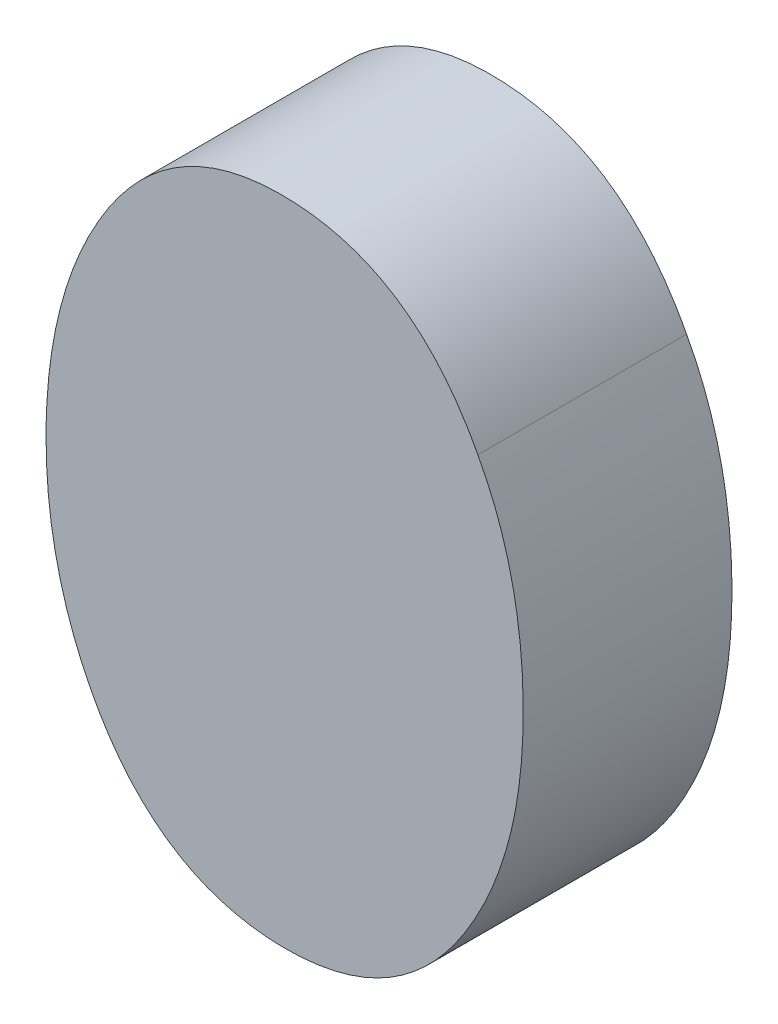
ISO-10303-21;
HEADER;
FILE_DESCRIPTION(('STEP AP214'),'2;1');
FILE_NAME('part.step','',(''),(''),'','','');
FILE_SCHEMA(('AUTOMOTIVE_DESIGN { 1 0 10303 214 1 1 1 1 }'));
ENDSEC;
DATA;
#1=APPLICATION_CONTEXT('core data for automotive mechanical design processes');
#2=APPLICATION_PROTOCOL_DEFINITION('international standard','automotive_design',2000,#1);
#3=PRODUCT_CONTEXT('',#1,'mechanical');
#4=PRODUCT('Part','Part','',(#3));
#5=PRODUCT_RELATED_PRODUCT_CATEGORY('part','',(#4));
#6=PRODUCT_DEFINITION_FORMATION('','',#4);
#7=PRODUCT_DEFINITION_CONTEXT('part definition',#1,'design');
#8=PRODUCT_DEFINITION('design','',#6,#7);
#9=PRODUCT_DEFINITION_SHAPE('','',#8);
#10=(LENGTH_UNIT() NAMED_UNIT(*) SI_UNIT(.MILLI.,.METRE.));
#11=(NAMED_UNIT(*) PLANE_ANGLE_UNIT() SI_UNIT($,.RADIAN.));
#12=(NAMED_UNIT(*) SI_UNIT($,.STERADIAN.) SOLID_ANGLE_UNIT());
#13=UNCERTAINTY_MEASURE_WITH_UNIT(LENGTH_MEASURE(1.E-05),#10,'distance_accuracy_value','');
#14=(GEOMETRIC_REPRESENTATION_CONTEXT(3) GLOBAL_UNCERTAINTY_ASSIGNED_CONTEXT((#13)) GLOBAL_UNIT_ASSIGNED_CONTEXT((#10,
#11,#12)) REPRESENTATION_CONTEXT('',''));
#15=CARTESIAN_POINT('',(0.,0.,0.));
#16=DIRECTION('',(0.,0.,1.));
#17=DIRECTION('',(1.,0.,0.));
#18=AXIS2_PLACEMENT_3D('',#15,#16,#17);
#19=CARTESIAN_POINT('',(173.744858544008,131.368774372739,-38.9997200126349));
#20=DIRECTION('',(0.,0.,-1.));
#21=DIRECTION('',(-1.,0.,0.));
#22=AXIS2_PLACEMENT_3D('',#19,#20,#21);
#23=PLANE('',#22);
#24=CARTESIAN_POINT('',(173.9034454652,131.332766214631,-38.9997200126349));
#25=CARTESIAN_POINT('',(173.908014798087,131.324429820084,-38.9997200126349));
#26=CARTESIAN_POINT('',(173.911753346443,131.315698091519,-38.9997200126349));
#27=CARTESIAN_POINT('',(173.917767937484,131.297737241665,-38.9997200126349));
#28=CARTESIAN_POINT('',(173.920044049126,131.28850814385,-38.9997200126349));
#29=CARTESIAN_POINT('',(173.92410120989,131.265487346003,-38.9997200126349));
#30=CARTESIAN_POINT('',(173.925154726982,131.25157758709,-38.9997200126349));
#31=CARTESIAN_POINT('',(173.925199285493,131.223729594472,-38.9997200126349));
#32=CARTESIAN_POINT('',(173.924187736672,131.209791346939,-38.9997200126349));
#33=CARTESIAN_POINT('',(173.920077770833,131.186582989459,-38.9997200126349));
#34=CARTESIAN_POINT('',(173.917713135645,131.1771902406,-38.9997200126349));
#35=CARTESIAN_POINT('',(173.911499948026,131.158922910163,-38.9997200126349));
#36=CARTESIAN_POINT('',(173.907654373367,131.150047329667,-38.9997200126349));
#37=CARTESIAN_POINT('',(173.899910426115,131.13558420799,-38.9997200126349));
#38=CARTESIAN_POINT('',(173.896368486896,131.129804333401,-38.9997200126349));
#39=CARTESIAN_POINT('',(173.888453564095,131.118835316594,-38.9997200126349));
#40=CARTESIAN_POINT('',(173.884081980822,131.113645202219,-38.9997200126349));
#41=CARTESIAN_POINT('',(173.87550212016,131.105236029308,-38.9997200126349));
#42=CARTESIAN_POINT('',(173.87147353095,131.101835278752,-38.9997200126349));
#43=CARTESIAN_POINT('',(173.862902183948,131.095763099117,-38.9997200126349));
#44=CARTESIAN_POINT('',(173.858360176809,131.09309062427,-38.9997200126349));
#45=CARTESIAN_POINT('',(173.848867032974,131.088589966005,-38.9997200126349));
#46=CARTESIAN_POINT('',(173.84391529639,131.086763047304,-38.9997200126349));
#47=CARTESIAN_POINT('',(173.833764810372,131.083977413198,-38.9997200126349));
#48=CARTESIAN_POINT('',(173.828565487571,131.08302082762,-38.9997200126349));
#49=CARTESIAN_POINT('',(173.818110620974,131.081898738138,-38.9997200126349));
#50=CARTESIAN_POINT('',(173.812855382256,131.08173010925,-38.9997200126349));
#51=CARTESIAN_POINT('',(173.802367109949,131.082070720413,-38.9997200126349));
#52=CARTESIAN_POINT('',(173.797134071073,131.082579788744,-38.9997200126349));
#53=CARTESIAN_POINT('',(173.786792342219,131.084404536079,-38.9997200126349));
#54=CARTESIAN_POINT('',(173.781683915822,131.085721792712,-38.9997200126349));
#55=CARTESIAN_POINT('',(173.77177673162,131.089204765122,-38.9997200126349));
#56=CARTESIAN_POINT('',(173.766977217797,131.091368310024,-38.9997200126349));
#57=CARTESIAN_POINT('',(173.757825187715,131.096496083361,-38.9997200126349));
#58=CARTESIAN_POINT('',(173.753472902209,131.099460722295,-38.9997200126349));
#59=CARTESIAN_POINT('',(173.745304502827,131.106057418902,-38.9997200126349));
#60=CARTESIAN_POINT('',(173.741489106349,131.109690354894,-38.9997200126349));
#61=CARTESIAN_POINT('',(173.734025772993,131.117879715374,-38.9997200126349));
#62=CARTESIAN_POINT('',(173.730442302138,131.122493750101,-38.9997200126349));
#63=CARTESIAN_POINT('',(173.723929472304,131.13209855056,-38.9997200126349));
#64=CARTESIAN_POINT('',(173.72099391046,131.13708507139,-38.9997200126349));
#65=CARTESIAN_POINT('',(173.718331830667,131.14218918975,-38.9997200126349));
#66=B_SPLINE_CURVE_WITH_KNOTS('',3,(#24,#25,#26,#27,#28,#29,#30,#31,#32,#33,#34,#35,#36,#37,#38,
#39,#40,#41,#42,#43,#44,#45,#46,#47,#48,#49,#50,#51,#52,#53,#54,#55,#56,#57,#58,#59,#60,#61,#62,
#63,#64,#65),.UNSPECIFIED.,.F.,.F.,(4,2,2,2,2,2,2,2,2,2,2,2,2,2,2,2,2,2,2,2,4),(0.,
0.0284002238752622,0.0567991085106313,0.0984596537863421,0.140172486566024,0.169113750862,
0.197997123348401,0.218283145768268,0.238535228279963,0.254285736121527,0.270013506391512,
0.285764725627308,0.301554387415125,0.31728137497848,0.333004378282418,0.348758171865596,
0.364471816503089,0.380193528458672,0.39593605244051,0.41340836395186,0.430705349465679),.UNSPECIFIED.);
#67=CARTESIAN_POINT('',(173.9034454652,131.332766214631,-38.9997200126349));
#68=VERTEX_POINT('',#67);
#69=CARTESIAN_POINT('',(173.718331830667,131.14218918975,-38.9997200126349));
#70=VERTEX_POINT('',#69);
#71=EDGE_CURVE('E53',#68,#70,#66,.T.);
#72=ORIENTED_EDGE('',*,*,#71,.F.);
#73=CARTESIAN_POINT('',(173.718331830667,131.14218918975,-38.9997200126349));
#74=CARTESIAN_POINT('',(173.713465161089,131.151433702495,-38.9997200126349));
#75=CARTESIAN_POINT('',(173.709474514871,131.161097828992,-38.9997200126349));
#76=CARTESIAN_POINT('',(173.703136808004,131.180947955797,-38.9997200126349));
#77=CARTESIAN_POINT('',(173.700788446171,131.191133536073,-38.9997200126349));
#78=CARTESIAN_POINT('',(173.697157768974,131.2147249678,-38.9997200126349));
#79=CARTESIAN_POINT('',(173.696385495814,131.228204322194,-38.9997200126349));
#80=CARTESIAN_POINT('',(173.696898251483,131.25514183702,-38.9997200126349));
#81=CARTESIAN_POINT('',(173.698185533359,131.268599958098,-38.9997200126349));
#82=CARTESIAN_POINT('',(173.702617759272,131.291403239048,-38.9997200126349));
#83=CARTESIAN_POINT('',(173.705154996063,131.300862334052,-38.9997200126349));
#84=CARTESIAN_POINT('',(173.711704303877,131.319246215228,-38.9997200126349));
#85=CARTESIAN_POINT('',(173.715713511503,131.3281719999,-38.9997200126349));
#86=CARTESIAN_POINT('',(173.723622066103,131.342396171386,-38.9997200126349));
#87=CARTESIAN_POINT('',(173.727120366499,131.347918958266,-38.9997200126349));
#88=CARTESIAN_POINT('',(173.734898322058,131.358391228469,-38.9997200126349));
#89=CARTESIAN_POINT('',(173.739176581082,131.363341710758,-38.9997200126349));
#90=CARTESIAN_POINT('',(173.747598975663,131.371412417255,-38.9997200126349));
#91=CARTESIAN_POINT('',(173.751582475385,131.374698659819,-38.9997200126349));
#92=CARTESIAN_POINT('',(173.760045855468,131.380549741944,-38.9997200126349));
#93=CARTESIAN_POINT('',(173.764525020381,131.383115602855,-38.9997200126349));
#94=CARTESIAN_POINT('',(173.773873490376,131.387415225856,-38.9997200126349));
#95=CARTESIAN_POINT('',(173.778743301064,131.389147888593,-38.9997200126349));
#96=CARTESIAN_POINT('',(173.788714048544,131.391764140243,-38.9997200126349));
#97=CARTESIAN_POINT('',(173.793815520235,131.392645647328,-38.9997200126349));
#98=CARTESIAN_POINT('',(173.804086205437,131.393643217148,-38.9997200126349));
#99=CARTESIAN_POINT('',(173.809255432629,131.393759122841,-38.9997200126349));
#100=CARTESIAN_POINT('',(173.819567010062,131.393338376308,-38.9997200126349));
#101=CARTESIAN_POINT('',(173.824709365319,131.392801850576,-38.9997200126349));
#102=CARTESIAN_POINT('',(173.83497847603,131.390930283696,-38.9997200126349));
#103=CARTESIAN_POINT('',(173.840102071977,131.389576915391,-38.9997200126349));
#104=CARTESIAN_POINT('',(173.850032702033,131.386018842797,-38.9997200126349));
#105=CARTESIAN_POINT('',(173.854840500084,131.383816288762,-38.9997200126349));
#106=CARTESIAN_POINT('',(173.864001857796,131.378612056683,-38.9997200126349));
#107=CARTESIAN_POINT('',(173.868355310932,131.375610191818,-38.9997200126349));
#108=CARTESIAN_POINT('',(173.876524346886,131.368943840898,-38.9997200126349));
#109=CARTESIAN_POINT('',(173.880339190828,131.36527846004,-38.9997200126349));
#110=CARTESIAN_POINT('',(173.887782664856,131.357050813192,-38.9997200126349));
#111=CARTESIAN_POINT('',(173.891350849299,131.35243494103,-38.9997200126349));
#112=CARTESIAN_POINT('',(173.897845698185,131.342836944387,-38.9997200126349));
#113=CARTESIAN_POINT('',(173.900778528535,131.337859030766,-38.9997200126349));
#114=CARTESIAN_POINT('',(173.9034454652,131.332766214631,-38.9997200126349));
#115=B_SPLINE_CURVE_WITH_KNOTS('',3,(#73,#74,#75,#76,#77,#78,#79,#80,#81,#82,#83,#84,#85,#86,
#87,#88,#89,#90,#91,#92,#93,#94,#95,#96,#97,#98,#99,#100,#101,#102,#103,#104,#105,#106,#107,
#108,#109,#110,#111,#112,#113,#114),.UNSPECIFIED.,.F.,.F.,(4,2,2,2,2,2,2,2,2,2,2,2,2,2,2,2,2,2,
2,2,4),(0.,0.0312452956068513,0.0624658073786385,0.10278381674285,0.143145962125516,
0.172416392621823,0.201630183025114,0.221195387434573,0.24072590767078,0.256153485646803,
0.271559078795236,0.286984943253559,0.30244844271982,0.31791511399735,0.333378787057574,
0.349203024041566,0.364987452289943,0.380775573011406,0.396585146078523,0.414035976474014,
0.431309003593059),.UNSPECIFIED.);
#116=EDGE_CURVE('E24',#70,#68,#115,.T.);
#117=ORIENTED_EDGE('',*,*,#116,.F.);
#118=EDGE_LOOP('',(#72,#117));
#119=FACE_BOUND('',#118,.T.);
#120=ADVANCED_FACE('F17',(#119),#23,.F.);
#121=CARTESIAN_POINT('',(173.9034454652,131.332766214631,-39.0997200126349));
#122=CARTESIAN_POINT('',(173.9034454652,131.332766214631,-38.9997200126349));
#123=CARTESIAN_POINT('',(173.882101125788,131.373528522731,-39.0997200126349));
#124=CARTESIAN_POINT('',(173.882101125788,131.373528522731,-38.9997200126349));
#125=CARTESIAN_POINT('',(173.850666735019,131.393644986468,-39.0997200126349));
#126=CARTESIAN_POINT('',(173.850666735019,131.393644986468,-38.9997200126349));
#127=CARTESIAN_POINT('',(173.769946324153,131.393644986468,-39.0997200126349));
#128=CARTESIAN_POINT('',(173.769946324153,131.393644986468,-38.9997200126349));
#129=CARTESIAN_POINT('',(173.739676170078,131.373528522731,-39.0997200126349));
#130=CARTESIAN_POINT('',(173.739676170078,131.373528522731,-38.9997200126349));
#131=CARTESIAN_POINT('',(173.704146658488,131.305676111366,-39.0997200126349));
#132=CARTESIAN_POINT('',(173.704146658488,131.305676111366,-38.9997200126349));
#133=CARTESIAN_POINT('',(173.696599412357,131.273475584668,-39.0997200126349));
#134=CARTESIAN_POINT('',(173.696599412357,131.273475584668,-38.9997200126349));
#135=CARTESIAN_POINT('',(173.696599412357,131.200950439089,-39.0997200126349));
#136=CARTESIAN_POINT('',(173.696599412357,131.200950439089,-38.9997200126349));
#137=CARTESIAN_POINT('',(173.703972911426,131.169716982233,-39.0997200126349));
#138=CARTESIAN_POINT('',(173.703972911426,131.169716982233,-38.9997200126349));
#139=CARTESIAN_POINT('',(173.718331830667,131.14218918975,-39.0997200126349));
#140=CARTESIAN_POINT('',(173.718331830667,131.14218918975,-38.9997200126349));
#141=B_SPLINE_SURFACE_WITH_KNOTS('',3,1,((#121,#122),(#123,#124),(#125,#126),(#127,#128),(#129,
#130),(#131,#132),(#133,#134),(#135,#136),(#137,#138),(#139,#140)),.UNSPECIFIED.,.F.,.F.,.F.,(4,
2,2,2,4),(2,2),(0.,0.309404738529147,0.607133826547679,0.805000731425108,1.),(1.,
1.09999999999999),.UNSPECIFIED.);
#142=CARTESIAN_POINT('',(173.718331830667,131.14218918975,-39.0997200126349));
#143=CARTESIAN_POINT('',(173.713465161089,131.151433702495,-39.0997200126349));
#144=CARTESIAN_POINT('',(173.709474514871,131.161097828992,-39.0997200126349));
#145=CARTESIAN_POINT('',(173.703136808004,131.180947955797,-39.0997200126349));
#146=CARTESIAN_POINT('',(173.700788446171,131.191133536073,-39.0997200126349));
#147=CARTESIAN_POINT('',(173.697157768974,131.2147249678,-39.0997200126349));
#148=CARTESIAN_POINT('',(173.696385495814,131.228204322194,-39.0997200126349));
#149=CARTESIAN_POINT('',(173.696898251483,131.25514183702,-39.0997200126349));
#150=CARTESIAN_POINT('',(173.698185533359,131.268599958098,-39.0997200126349));
#151=CARTESIAN_POINT('',(173.702617759272,131.291403239048,-39.0997200126349));
#152=CARTESIAN_POINT('',(173.705154996063,131.300862334052,-39.0997200126349));
#153=CARTESIAN_POINT('',(173.711704303877,131.319246215228,-39.0997200126349));
#154=CARTESIAN_POINT('',(173.715713511503,131.3281719999,-39.0997200126349));
#155=CARTESIAN_POINT('',(173.723622066103,131.342396171386,-39.0997200126349));
#156=CARTESIAN_POINT('',(173.727120366499,131.347918958266,-39.0997200126349));
#157=CARTESIAN_POINT('',(173.734898322058,131.358391228469,-39.0997200126349));
#158=CARTESIAN_POINT('',(173.739176581082,131.363341710758,-39.0997200126349));
#159=CARTESIAN_POINT('',(173.747598975663,131.371412417255,-39.0997200126349));
#160=CARTESIAN_POINT('',(173.751582475385,131.374698659819,-39.0997200126349));
#161=CARTESIAN_POINT('',(173.760045855468,131.380549741944,-39.0997200126349));
#162=CARTESIAN_POINT('',(173.764525020381,131.383115602855,-39.0997200126349));
#163=CARTESIAN_POINT('',(173.773873490376,131.387415225856,-39.0997200126349));
#164=CARTESIAN_POINT('',(173.778743301064,131.389147888593,-39.0997200126349));
#165=CARTESIAN_POINT('',(173.788714048544,131.391764140243,-39.0997200126349));
#166=CARTESIAN_POINT('',(173.793815520235,131.392645647328,-39.0997200126349));
#167=CARTESIAN_POINT('',(173.804086205437,131.393643217148,-39.0997200126349));
#168=CARTESIAN_POINT('',(173.80925543263,131.393759122841,-39.0997200126349));
#169=CARTESIAN_POINT('',(173.819567010062,131.393338376308,-39.0997200126349));
#170=CARTESIAN_POINT('',(173.824709365319,131.392801850576,-39.0997200126349));
#171=CARTESIAN_POINT('',(173.83497847603,131.390930283696,-39.0997200126349));
#172=CARTESIAN_POINT('',(173.840102071977,131.389576915391,-39.0997200126349));
#173=CARTESIAN_POINT('',(173.850032702033,131.386018842797,-39.0997200126349));
#174=CARTESIAN_POINT('',(173.854840500084,131.383816288762,-39.0997200126349));
#175=CARTESIAN_POINT('',(173.864001857796,131.378612056682,-39.0997200126349));
#176=CARTESIAN_POINT('',(173.868355310932,131.375610191818,-39.0997200126349));
#177=CARTESIAN_POINT('',(173.876524346886,131.368943840898,-39.0997200126349));
#178=CARTESIAN_POINT('',(173.880339190828,131.36527846004,-39.0997200126349));
#179=CARTESIAN_POINT('',(173.887782664856,131.357050813192,-39.0997200126349));
#180=CARTESIAN_POINT('',(173.891350849299,131.35243494103,-39.0997200126349));
#181=CARTESIAN_POINT('',(173.897845698185,131.342836944387,-39.0997200126349));
#182=CARTESIAN_POINT('',(173.900778528535,131.337859030766,-39.0997200126349));
#183=CARTESIAN_POINT('',(173.9034454652,131.332766214631,-39.0997200126349));
#184=B_SPLINE_CURVE_WITH_KNOTS('',3,(#142,#143,#144,#145,#146,#147,#148,#149,#150,#151,#152,
#153,#154,#155,#156,#157,#158,#159,#160,#161,#162,#163,#164,#165,#166,#167,#168,#169,#170,#171,
#172,#173,#174,#175,#176,#177,#178,#179,#180,#181,#182,#183),.UNSPECIFIED.,.F.,.F.,(4,2,2,2,2,2,
2,2,2,2,2,2,2,2,2,2,2,2,2,2,4),(0.,0.0312452956068513,0.0624658073786385,0.102783816742852,
0.143145962125521,0.172416392621827,0.201630183025118,0.221195387434586,0.24072590767079,
0.256153485646856,0.271559078795317,0.286984943253682,0.302448442720026,0.317915113997582,
0.333378787057816,0.349203024041754,0.364987452290055,0.38077557301148,0.39658514607848,
0.414035976474005,0.43130900359307),.UNSPECIFIED.);
#185=CARTESIAN_POINT('',(173.718331830667,131.14218918975,-39.0997200126349));
#186=VERTEX_POINT('',#185);
#187=CARTESIAN_POINT('',(173.9034454652,131.332766214631,-39.0997200126349));
#188=VERTEX_POINT('',#187);
#189=EDGE_CURVE('E35',#186,#188,#184,.T.);
#190=DIRECTION('',(0.,0.,-1.));
#191=VECTOR('',#190,1.);
#192=CARTESIAN_POINT('',(173.718331830667,131.14218918975,-39.0497200126349));
#193=LINE('',#192,#191);
#194=EDGE_CURVE('E56',#70,#186,#193,.T.);
#195=DIRECTION('',(0.,0.,1.));
#196=VECTOR('',#195,1.);
#197=CARTESIAN_POINT('',(173.9034454652,131.332766214631,-39.0497200126349));
#198=LINE('',#197,#196);
#199=EDGE_CURVE('E44',#188,#68,#198,.T.);
#200=ORIENTED_EDGE('',*,*,#189,.F.);
#201=ORIENTED_EDGE('',*,*,#194,.F.);
#202=ORIENTED_EDGE('',*,*,#116,.T.);
#203=ORIENTED_EDGE('',*,*,#199,.F.);
#204=EDGE_LOOP('',(#200,#201,#202,#203));
#205=FACE_BOUND('',#204,.T.);
#206=ADVANCED_FACE('F57',(#205),#141,.T.);
#207=CARTESIAN_POINT('',(173.718331830667,131.14218918975,-39.0997200126349));
#208=CARTESIAN_POINT('',(173.718331830667,131.14218918975,-38.9997200126349));
#209=CARTESIAN_POINT('',(173.739395075811,131.101808390079,-39.0997200126349));
#210=CARTESIAN_POINT('',(173.739395075811,131.101808390079,-38.9997200126349));
#211=CARTESIAN_POINT('',(173.77072248195,131.081839798538,-39.0997200126349));
#212=CARTESIAN_POINT('',(173.77072248195,131.081839798538,-38.9997200126349));
#213=CARTESIAN_POINT('',(173.851442892815,131.081839798538,-39.0997200126349));
#214=CARTESIAN_POINT('',(173.851442892815,131.081839798538,-38.9997200126349));
#215=CARTESIAN_POINT('',(173.882101125788,131.101956262275,-39.0997200126349));
#216=CARTESIAN_POINT('',(173.882101125788,131.101956262275,-38.9997200126349));
#217=CARTESIAN_POINT('',(173.918081009141,131.169776399951,-39.0997200126349));
#218=CARTESIAN_POINT('',(173.918081009141,131.169776399951,-38.9997200126349));
#219=CARTESIAN_POINT('',(173.92517788351,131.200950439089,-39.0997200126349));
#220=CARTESIAN_POINT('',(173.92517788351,131.200950439089,-38.9997200126349));
#221=CARTESIAN_POINT('',(173.92517788351,131.273475584668,-39.0997200126349));
#222=CARTESIAN_POINT('',(173.92517788351,131.273475584668,-38.9997200126349));
#223=CARTESIAN_POINT('',(173.918192463339,131.305767802773,-39.0997200126349));
#224=CARTESIAN_POINT('',(173.918192463339,131.305767802773,-38.9997200126349));
#225=CARTESIAN_POINT('',(173.9034454652,131.332766214631,-39.0997200126349));
#226=CARTESIAN_POINT('',(173.9034454652,131.332766214631,-38.9997200126349));
#227=B_SPLINE_SURFACE_WITH_KNOTS('',3,1,((#207,#208),(#209,#210),(#211,#212),(#213,#214),(#215,
#216),(#217,#218),(#219,#220),(#221,#222),(#223,#224),(#225,#226)),.UNSPECIFIED.,.F.,.F.,.F.,(4,
2,2,2,4),(2,2),(0.,0.29975145228622,0.593793353100384,0.795414170539628,1.),(1.,
1.09999999999999),.UNSPECIFIED.);
#228=CARTESIAN_POINT('',(173.9034454652,131.332766214631,-39.0997200126349));
#229=CARTESIAN_POINT('',(173.908014798087,131.324429820085,-39.0997200126349));
#230=CARTESIAN_POINT('',(173.911753346443,131.315698091519,-39.0997200126349));
#231=CARTESIAN_POINT('',(173.917767937484,131.297737241665,-39.0997200126349));
#232=CARTESIAN_POINT('',(173.920044049126,131.28850814385,-39.0997200126349));
#233=CARTESIAN_POINT('',(173.92410120989,131.265487346003,-39.0997200126349));
#234=CARTESIAN_POINT('',(173.925154726982,131.25157758709,-39.0997200126349));
#235=CARTESIAN_POINT('',(173.925199285494,131.223729594472,-39.0997200126349));
#236=CARTESIAN_POINT('',(173.924187736672,131.209791346939,-39.0997200126349));
#237=CARTESIAN_POINT('',(173.920077770833,131.186582989459,-39.0997200126349));
#238=CARTESIAN_POINT('',(173.917713135645,131.1771902406,-39.0997200126349));
#239=CARTESIAN_POINT('',(173.911499948026,131.158922910163,-39.0997200126349));
#240=CARTESIAN_POINT('',(173.907654373367,131.150047329667,-39.0997200126349));
#241=CARTESIAN_POINT('',(173.899910426115,131.13558420799,-39.0997200126349));
#242=CARTESIAN_POINT('',(173.896368486896,131.129804333401,-39.0997200126349));
#243=CARTESIAN_POINT('',(173.888453564095,131.118835316594,-39.0997200126349));
#244=CARTESIAN_POINT('',(173.884081980822,131.113645202219,-39.0997200126349));
#245=CARTESIAN_POINT('',(173.87550212016,131.105236029308,-39.0997200126349));
#246=CARTESIAN_POINT('',(173.87147353095,131.101835278752,-39.0997200126349));
#247=CARTESIAN_POINT('',(173.862902183948,131.095763099117,-39.0997200126349));
#248=CARTESIAN_POINT('',(173.858360176809,131.09309062427,-39.0997200126349));
#249=CARTESIAN_POINT('',(173.848867032974,131.088589966005,-39.0997200126349));
#250=CARTESIAN_POINT('',(173.84391529639,131.086763047304,-39.0997200126349));
#251=CARTESIAN_POINT('',(173.833764810372,131.083977413199,-39.0997200126349));
#252=CARTESIAN_POINT('',(173.828565487571,131.08302082762,-39.0997200126349));
#253=CARTESIAN_POINT('',(173.818110620974,131.081898738138,-39.0997200126349));
#254=CARTESIAN_POINT('',(173.812855382256,131.08173010925,-39.0997200126349));
#255=CARTESIAN_POINT('',(173.802367109949,131.082070720413,-39.0997200126349));
#256=CARTESIAN_POINT('',(173.797134071073,131.082579788744,-39.0997200126349));
#257=CARTESIAN_POINT('',(173.786792342219,131.084404536079,-39.0997200126349));
#258=CARTESIAN_POINT('',(173.781683915822,131.085721792712,-39.0997200126349));
#259=CARTESIAN_POINT('',(173.77177673162,131.089204765122,-39.0997200126349));
#260=CARTESIAN_POINT('',(173.766977217797,131.091368310023,-39.0997200126349));
#261=CARTESIAN_POINT('',(173.757825187715,131.096496083361,-39.0997200126349));
#262=CARTESIAN_POINT('',(173.753472902209,131.099460722295,-39.0997200126349));
#263=CARTESIAN_POINT('',(173.745304502827,131.106057418902,-39.0997200126349));
#264=CARTESIAN_POINT('',(173.741489106349,131.109690354894,-39.0997200126349));
#265=CARTESIAN_POINT('',(173.734025772993,131.117879715373,-39.0997200126349));
#266=CARTESIAN_POINT('',(173.730442302138,131.122493750101,-39.0997200126349));
#267=CARTESIAN_POINT('',(173.723929472304,131.13209855056,-39.0997200126349));
#268=CARTESIAN_POINT('',(173.72099391046,131.13708507139,-39.0997200126349));
#269=CARTESIAN_POINT('',(173.718331830667,131.14218918975,-39.0997200126349));
#270=B_SPLINE_CURVE_WITH_KNOTS('',3,(#228,#229,#230,#231,#232,#233,#234,#235,#236,#237,#238,
#239,#240,#241,#242,#243,#244,#245,#246,#247,#248,#249,#250,#251,#252,#253,#254,#255,#256,#257,
#258,#259,#260,#261,#262,#263,#264,#265,#266,#267,#268,#269),.UNSPECIFIED.,.F.,.F.,(4,2,2,2,2,2,
2,2,2,2,2,2,2,2,2,2,2,2,2,2,4),(0.,0.0284002238752478,0.056799108510637,0.0984596537863502,
0.140172486566034,0.169113750862003,0.197997123348416,0.218283145768283,0.238535228279978,
0.254285736121563,0.270013506391524,0.285764725627311,0.301554387415133,0.317281374978487,
0.333004378282425,0.348758171865604,0.364471816503096,0.380193528458665,0.395936052440505,
0.413408363951838,0.430705349465671),.UNSPECIFIED.);
#271=EDGE_CURVE('E11',#188,#186,#270,.T.);
#272=ORIENTED_EDGE('',*,*,#271,.F.);
#273=ORIENTED_EDGE('',*,*,#199,.T.);
#274=ORIENTED_EDGE('',*,*,#71,.T.);
#275=ORIENTED_EDGE('',*,*,#194,.T.);
#276=EDGE_LOOP('',(#272,#273,#274,#275));
#277=FACE_BOUND('',#276,.T.);
#278=ADVANCED_FACE('F19',(#277),#227,.T.);
#279=CARTESIAN_POINT('',(173.744858544008,131.368774372739,-39.0997200126349));
#280=DIRECTION('',(0.,0.,-1.));
#281=DIRECTION('',(-1.,0.,0.));
#282=AXIS2_PLACEMENT_3D('',#279,#280,#281);
#283=PLANE('',#282);
#284=ORIENTED_EDGE('',*,*,#189,.T.);
#285=ORIENTED_EDGE('',*,*,#271,.T.);
#286=EDGE_LOOP('',(#284,#285));
#287=FACE_BOUND('',#286,.T.);
#288=ADVANCED_FACE('F71',(#287),#283,.T.);
#289=CLOSED_SHELL('',(#120,#206,#278,#288));
#290=MANIFOLD_SOLID_BREP('B1',#289);
#291=ADVANCED_BREP_SHAPE_REPRESENTATION('',(#18,#290),#14);
#292=SHAPE_DEFINITION_REPRESENTATION(#9,#291);
ENDSEC;
END-ISO-10303-21;
